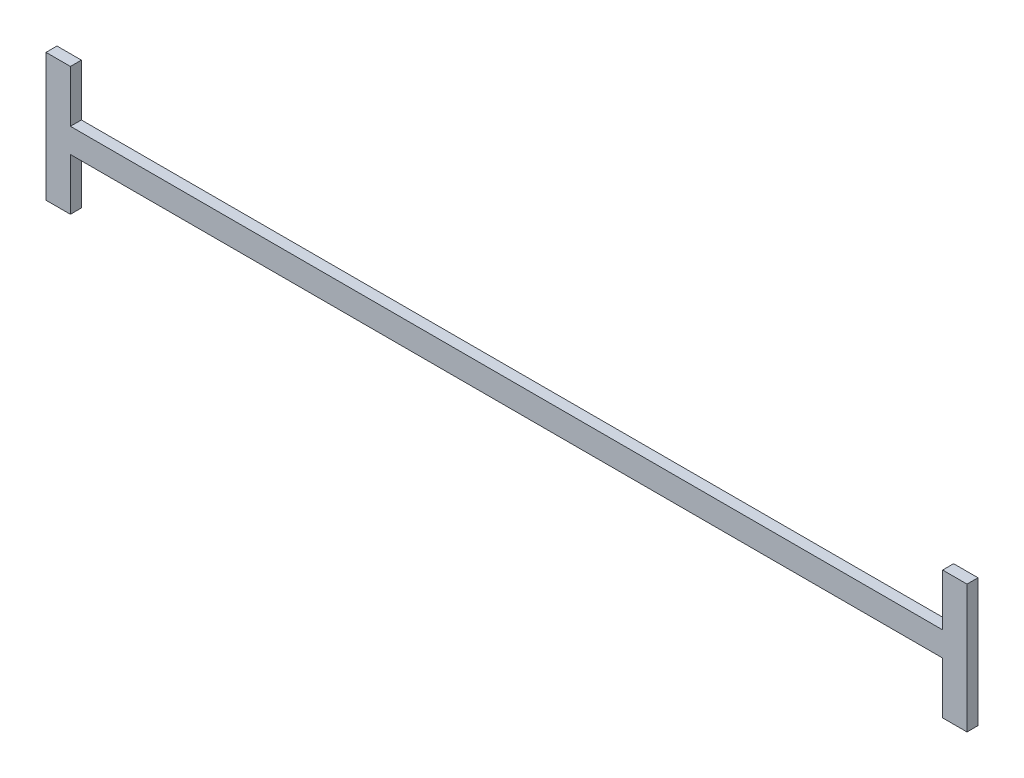
ISO-10303-21;
HEADER;
FILE_DESCRIPTION(('STEP AP214'),'2;1');
FILE_NAME('part.step','',(''),(''),'','','');
FILE_SCHEMA(('AUTOMOTIVE_DESIGN { 1 0 10303 214 1 1 1 1 }'));
ENDSEC;
DATA;
#1=APPLICATION_CONTEXT('core data for automotive mechanical design processes');
#2=APPLICATION_PROTOCOL_DEFINITION('international standard','automotive_design',2000,#1);
#3=PRODUCT_CONTEXT('',#1,'mechanical');
#4=PRODUCT('Part','Part','',(#3));
#5=PRODUCT_RELATED_PRODUCT_CATEGORY('part','',(#4));
#6=PRODUCT_DEFINITION_FORMATION('','',#4);
#7=PRODUCT_DEFINITION_CONTEXT('part definition',#1,'design');
#8=PRODUCT_DEFINITION('design','',#6,#7);
#9=PRODUCT_DEFINITION_SHAPE('','',#8);
#10=(LENGTH_UNIT() NAMED_UNIT(*) SI_UNIT(.MILLI.,.METRE.));
#11=(NAMED_UNIT(*) PLANE_ANGLE_UNIT() SI_UNIT($,.RADIAN.));
#12=(NAMED_UNIT(*) SI_UNIT($,.STERADIAN.) SOLID_ANGLE_UNIT());
#13=UNCERTAINTY_MEASURE_WITH_UNIT(LENGTH_MEASURE(1.E-05),#10,'distance_accuracy_value','');
#14=(GEOMETRIC_REPRESENTATION_CONTEXT(3) GLOBAL_UNCERTAINTY_ASSIGNED_CONTEXT((#13)) GLOBAL_UNIT_ASSIGNED_CONTEXT((#10,
#11,#12)) REPRESENTATION_CONTEXT('',''));
#15=CARTESIAN_POINT('',(0.,0.,0.));
#16=DIRECTION('',(0.,0.,1.));
#17=DIRECTION('',(1.,0.,0.));
#18=AXIS2_PLACEMENT_3D('',#15,#16,#17);
#19=CARTESIAN_POINT('',(-71.5,0.,1.8));
#20=DIRECTION('',(-1.,0.,0.));
#21=DIRECTION('',(0.,0.,1.));
#22=AXIS2_PLACEMENT_3D('',#19,#20,#21);
#23=PLANE('',#22);
#24=DIRECTION('',(0.,1.,0.));
#25=VECTOR('',#24,1.);
#26=CARTESIAN_POINT('',(-71.5,0.,0.));
#27=LINE('',#26,#25);
#28=CARTESIAN_POINT('',(-71.5,-8.50000000000001,0.));
#29=VERTEX_POINT('',#28);
#30=CARTESIAN_POINT('',(-71.5,0.,0.));
#31=VERTEX_POINT('',#30);
#32=EDGE_CURVE('E153',#29,#31,#27,.T.);
#33=ORIENTED_EDGE('',*,*,#32,.T.);
#34=DIRECTION('',(0.,0.,-1.));
#35=VECTOR('',#34,1.);
#36=CARTESIAN_POINT('',(-71.5,0.,1.8));
#37=LINE('',#36,#35);
#38=CARTESIAN_POINT('',(-71.5,0.,1.8));
#39=VERTEX_POINT('',#38);
#40=EDGE_CURVE('E11',#39,#31,#37,.T.);
#41=ORIENTED_EDGE('',*,*,#40,.F.);
#42=DIRECTION('',(0.,1.,0.));
#43=VECTOR('',#42,1.);
#44=CARTESIAN_POINT('',(-71.5,0.,1.8));
#45=LINE('',#44,#43);
#46=CARTESIAN_POINT('',(-71.5,-8.50000000000001,1.8));
#47=VERTEX_POINT('',#46);
#48=EDGE_CURVE('E175',#47,#39,#45,.T.);
#49=ORIENTED_EDGE('',*,*,#48,.F.);
#50=DIRECTION('',(0.,0.,-1.));
#51=VECTOR('',#50,1.);
#52=CARTESIAN_POINT('',(-71.5,-8.50000000000001,1.8));
#53=LINE('',#52,#51);
#54=EDGE_CURVE('E149',#47,#29,#53,.T.);
#55=ORIENTED_EDGE('',*,*,#54,.T.);
#56=EDGE_LOOP('',(#33,#41,#49,#55));
#57=FACE_BOUND('',#56,.T.);
#58=ADVANCED_FACE('F33',(#57),#23,.F.);
#59=CARTESIAN_POINT('',(71.5,0.,1.8));
#60=DIRECTION('',(0.,1.,0.));
#61=DIRECTION('',(0.,0.,1.));
#62=AXIS2_PLACEMENT_3D('',#59,#60,#61);
#63=PLANE('',#62);
#64=DIRECTION('',(1.,0.,0.));
#65=VECTOR('',#64,1.);
#66=CARTESIAN_POINT('',(71.5,0.,0.));
#67=LINE('',#66,#65);
#68=CARTESIAN_POINT('',(71.5,0.,0.));
#69=VERTEX_POINT('',#68);
#70=EDGE_CURVE('E156',#31,#69,#67,.T.);
#71=ORIENTED_EDGE('',*,*,#70,.T.);
#72=DIRECTION('',(0.,0.,-1.));
#73=VECTOR('',#72,1.);
#74=CARTESIAN_POINT('',(71.5,0.,1.8));
#75=LINE('',#74,#73);
#76=CARTESIAN_POINT('',(71.5,0.,1.8));
#77=VERTEX_POINT('',#76);
#78=EDGE_CURVE('E41',#77,#69,#75,.T.);
#79=ORIENTED_EDGE('',*,*,#78,.F.);
#80=DIRECTION('',(1.,0.,0.));
#81=VECTOR('',#80,1.);
#82=CARTESIAN_POINT('',(71.5,0.,1.8));
#83=LINE('',#82,#81);
#84=EDGE_CURVE('E104',#39,#77,#83,.T.);
#85=ORIENTED_EDGE('',*,*,#84,.F.);
#86=ORIENTED_EDGE('',*,*,#40,.T.);
#87=EDGE_LOOP('',(#71,#79,#85,#86));
#88=FACE_BOUND('',#87,.T.);
#89=ADVANCED_FACE('F253',(#88),#63,.F.);
#90=CARTESIAN_POINT('',(71.5,0.,1.8));
#91=DIRECTION('',(1.,0.,0.));
#92=DIRECTION('',(0.,0.,-1.));
#93=AXIS2_PLACEMENT_3D('',#90,#91,#92);
#94=PLANE('',#93);
#95=DIRECTION('',(0.,-1.,0.));
#96=VECTOR('',#95,1.);
#97=CARTESIAN_POINT('',(71.5,0.,0.));
#98=LINE('',#97,#96);
#99=CARTESIAN_POINT('',(71.5,-8.50000000000001,0.));
#100=VERTEX_POINT('',#99);
#101=EDGE_CURVE('E158',#69,#100,#98,.T.);
#102=ORIENTED_EDGE('',*,*,#101,.T.);
#103=DIRECTION('',(0.,0.,-1.));
#104=VECTOR('',#103,1.);
#105=CARTESIAN_POINT('',(71.5,-8.50000000000001,1.8));
#106=LINE('',#105,#104);
#107=CARTESIAN_POINT('',(71.5,-8.50000000000001,1.8));
#108=VERTEX_POINT('',#107);
#109=EDGE_CURVE('E194',#108,#100,#106,.T.);
#110=ORIENTED_EDGE('',*,*,#109,.F.);
#111=DIRECTION('',(0.,-1.,0.));
#112=VECTOR('',#111,1.);
#113=CARTESIAN_POINT('',(71.5,0.,1.8));
#114=LINE('',#113,#112);
#115=EDGE_CURVE('E202',#77,#108,#114,.T.);
#116=ORIENTED_EDGE('',*,*,#115,.F.);
#117=ORIENTED_EDGE('',*,*,#78,.T.);
#118=EDGE_LOOP('',(#102,#110,#116,#117));
#119=FACE_BOUND('',#118,.T.);
#120=ADVANCED_FACE('F200',(#119),#94,.F.);
#121=CARTESIAN_POINT('',(71.5,-8.50000000000001,1.8));
#122=DIRECTION('',(0.,1.,0.));
#123=DIRECTION('',(0.,0.,1.));
#124=AXIS2_PLACEMENT_3D('',#121,#122,#123);
#125=PLANE('',#124);
#126=DIRECTION('',(1.,0.,0.));
#127=VECTOR('',#126,1.);
#128=CARTESIAN_POINT('',(71.5,-8.50000000000001,0.));
#129=LINE('',#128,#127);
#130=CARTESIAN_POINT('',(75.5,-8.50000000000001,0.));
#131=VERTEX_POINT('',#130);
#132=EDGE_CURVE('E160',#100,#131,#129,.T.);
#133=ORIENTED_EDGE('',*,*,#132,.T.);
#134=DIRECTION('',(0.,0.,-1.));
#135=VECTOR('',#134,1.);
#136=CARTESIAN_POINT('',(75.5,-8.50000000000001,1.8));
#137=LINE('',#136,#135);
#138=CARTESIAN_POINT('',(75.5,-8.50000000000001,1.8));
#139=VERTEX_POINT('',#138);
#140=EDGE_CURVE('E191',#139,#131,#137,.T.);
#141=ORIENTED_EDGE('',*,*,#140,.F.);
#142=DIRECTION('',(1.,0.,0.));
#143=VECTOR('',#142,1.);
#144=CARTESIAN_POINT('',(71.5,-8.50000000000001,1.8));
#145=LINE('',#144,#143);
#146=EDGE_CURVE('E220',#108,#139,#145,.T.);
#147=ORIENTED_EDGE('',*,*,#146,.F.);
#148=ORIENTED_EDGE('',*,*,#109,.T.);
#149=EDGE_LOOP('',(#133,#141,#147,#148));
#150=FACE_BOUND('',#149,.T.);
#151=ADVANCED_FACE('F211',(#150),#125,.F.);
#152=CARTESIAN_POINT('',(75.5,-8.50000000000001,1.8));
#153=DIRECTION('',(-1.,0.,0.));
#154=DIRECTION('',(0.,0.,1.));
#155=AXIS2_PLACEMENT_3D('',#152,#153,#154);
#156=PLANE('',#155);
#157=DIRECTION('',(0.,1.,0.));
#158=VECTOR('',#157,1.);
#159=CARTESIAN_POINT('',(75.5,-8.50000000000001,0.));
#160=LINE('',#159,#158);
#161=CARTESIAN_POINT('',(75.5,12.5,0.));
#162=VERTEX_POINT('',#161);
#163=EDGE_CURVE('E162',#131,#162,#160,.T.);
#164=ORIENTED_EDGE('',*,*,#163,.T.);
#165=DIRECTION('',(0.,0.,-1.));
#166=VECTOR('',#165,1.);
#167=CARTESIAN_POINT('',(75.5,12.5,1.8));
#168=LINE('',#167,#166);
#169=CARTESIAN_POINT('',(75.5,12.5,1.8));
#170=VERTEX_POINT('',#169);
#171=EDGE_CURVE('E188',#170,#162,#168,.T.);
#172=ORIENTED_EDGE('',*,*,#171,.F.);
#173=DIRECTION('',(0.,1.,0.));
#174=VECTOR('',#173,1.);
#175=CARTESIAN_POINT('',(75.5,-8.50000000000001,1.8));
#176=LINE('',#175,#174);
#177=EDGE_CURVE('E217',#139,#170,#176,.T.);
#178=ORIENTED_EDGE('',*,*,#177,.F.);
#179=ORIENTED_EDGE('',*,*,#140,.T.);
#180=EDGE_LOOP('',(#164,#172,#178,#179));
#181=FACE_BOUND('',#180,.T.);
#182=ADVANCED_FACE('F215',(#181),#156,.F.);
#183=CARTESIAN_POINT('',(75.5,12.5,1.8));
#184=DIRECTION('',(0.,-1.,0.));
#185=DIRECTION('',(0.,0.,-1.));
#186=AXIS2_PLACEMENT_3D('',#183,#184,#185);
#187=PLANE('',#186);
#188=DIRECTION('',(-1.,0.,0.));
#189=VECTOR('',#188,1.);
#190=CARTESIAN_POINT('',(75.5,12.5,0.));
#191=LINE('',#190,#189);
#192=CARTESIAN_POINT('',(71.5,12.5,0.));
#193=VERTEX_POINT('',#192);
#194=EDGE_CURVE('E164',#162,#193,#191,.T.);
#195=ORIENTED_EDGE('',*,*,#194,.T.);
#196=DIRECTION('',(0.,0.,-1.));
#197=VECTOR('',#196,1.);
#198=CARTESIAN_POINT('',(71.5,12.5,1.8));
#199=LINE('',#198,#197);
#200=CARTESIAN_POINT('',(71.5,12.5,1.8));
#201=VERTEX_POINT('',#200);
#202=EDGE_CURVE('E185',#201,#193,#199,.T.);
#203=ORIENTED_EDGE('',*,*,#202,.F.);
#204=DIRECTION('',(-1.,0.,0.));
#205=VECTOR('',#204,1.);
#206=CARTESIAN_POINT('',(75.5,12.5,1.8));
#207=LINE('',#206,#205);
#208=EDGE_CURVE('E219',#170,#201,#207,.T.);
#209=ORIENTED_EDGE('',*,*,#208,.F.);
#210=ORIENTED_EDGE('',*,*,#171,.T.);
#211=EDGE_LOOP('',(#195,#203,#209,#210));
#212=FACE_BOUND('',#211,.T.);
#213=ADVANCED_FACE('F266',(#212),#187,.F.);
#214=CARTESIAN_POINT('',(71.5,12.5,1.8));
#215=DIRECTION('',(1.,0.,0.));
#216=DIRECTION('',(0.,0.,-1.));
#217=AXIS2_PLACEMENT_3D('',#214,#215,#216);
#218=PLANE('',#217);
#219=DIRECTION('',(0.,-1.,0.));
#220=VECTOR('',#219,1.);
#221=CARTESIAN_POINT('',(71.5,12.5,0.));
#222=LINE('',#221,#220);
#223=CARTESIAN_POINT('',(71.5,3.99999999999999,0.));
#224=VERTEX_POINT('',#223);
#225=EDGE_CURVE('E166',#193,#224,#222,.T.);
#226=ORIENTED_EDGE('',*,*,#225,.T.);
#227=DIRECTION('',(0.,0.,-1.));
#228=VECTOR('',#227,1.);
#229=CARTESIAN_POINT('',(71.5,3.99999999999999,1.8));
#230=LINE('',#229,#228);
#231=CARTESIAN_POINT('',(71.5,3.99999999999999,1.8));
#232=VERTEX_POINT('',#231);
#233=EDGE_CURVE('E182',#232,#224,#230,.T.);
#234=ORIENTED_EDGE('',*,*,#233,.F.);
#235=DIRECTION('',(0.,-1.,0.));
#236=VECTOR('',#235,1.);
#237=CARTESIAN_POINT('',(71.5,12.5,1.8));
#238=LINE('',#237,#236);
#239=EDGE_CURVE('E222',#201,#232,#238,.T.);
#240=ORIENTED_EDGE('',*,*,#239,.F.);
#241=ORIENTED_EDGE('',*,*,#202,.T.);
#242=EDGE_LOOP('',(#226,#234,#240,#241));
#243=FACE_BOUND('',#242,.T.);
#244=ADVANCED_FACE('F269',(#243),#218,.F.);
#245=CARTESIAN_POINT('',(-71.5,3.99999999999999,1.8));
#246=DIRECTION('',(0.,-1.,0.));
#247=DIRECTION('',(0.,0.,-1.));
#248=AXIS2_PLACEMENT_3D('',#245,#246,#247);
#249=PLANE('',#248);
#250=DIRECTION('',(-1.,0.,0.));
#251=VECTOR('',#250,1.);
#252=CARTESIAN_POINT('',(-71.5,3.99999999999999,0.));
#253=LINE('',#252,#251);
#254=CARTESIAN_POINT('',(-71.5,3.99999999999999,0.));
#255=VERTEX_POINT('',#254);
#256=EDGE_CURVE('E168',#224,#255,#253,.T.);
#257=ORIENTED_EDGE('',*,*,#256,.T.);
#258=DIRECTION('',(0.,0.,-1.));
#259=VECTOR('',#258,1.);
#260=CARTESIAN_POINT('',(-71.5,3.99999999999999,1.8));
#261=LINE('',#260,#259);
#262=CARTESIAN_POINT('',(-71.5,3.99999999999999,1.8));
#263=VERTEX_POINT('',#262);
#264=EDGE_CURVE('E179',#263,#255,#261,.T.);
#265=ORIENTED_EDGE('',*,*,#264,.F.);
#266=DIRECTION('',(-1.,0.,0.));
#267=VECTOR('',#266,1.);
#268=CARTESIAN_POINT('',(-71.5,3.99999999999999,1.8));
#269=LINE('',#268,#267);
#270=EDGE_CURVE('E228',#232,#263,#269,.T.);
#271=ORIENTED_EDGE('',*,*,#270,.F.);
#272=ORIENTED_EDGE('',*,*,#233,.T.);
#273=EDGE_LOOP('',(#257,#265,#271,#272));
#274=FACE_BOUND('',#273,.T.);
#275=ADVANCED_FACE('F234',(#274),#249,.F.);
#276=CARTESIAN_POINT('',(-71.5,12.5,1.8));
#277=DIRECTION('',(-1.,0.,0.));
#278=DIRECTION('',(0.,0.,1.));
#279=AXIS2_PLACEMENT_3D('',#276,#277,#278);
#280=PLANE('',#279);
#281=DIRECTION('',(0.,1.,0.));
#282=VECTOR('',#281,1.);
#283=CARTESIAN_POINT('',(-71.5,12.5,0.));
#284=LINE('',#283,#282);
#285=CARTESIAN_POINT('',(-71.5,12.5,0.));
#286=VERTEX_POINT('',#285);
#287=EDGE_CURVE('E170',#255,#286,#284,.T.);
#288=ORIENTED_EDGE('',*,*,#287,.T.);
#289=DIRECTION('',(0.,0.,-1.));
#290=VECTOR('',#289,1.);
#291=CARTESIAN_POINT('',(-71.5,12.5,1.8));
#292=LINE('',#291,#290);
#293=CARTESIAN_POINT('',(-71.5,12.5,1.8));
#294=VERTEX_POINT('',#293);
#295=EDGE_CURVE('E144',#294,#286,#292,.T.);
#296=ORIENTED_EDGE('',*,*,#295,.F.);
#297=DIRECTION('',(0.,1.,0.));
#298=VECTOR('',#297,1.);
#299=CARTESIAN_POINT('',(-71.5,12.5,1.8));
#300=LINE('',#299,#298);
#301=EDGE_CURVE('E135',#263,#294,#300,.T.);
#302=ORIENTED_EDGE('',*,*,#301,.F.);
#303=ORIENTED_EDGE('',*,*,#264,.T.);
#304=EDGE_LOOP('',(#288,#296,#302,#303));
#305=FACE_BOUND('',#304,.T.);
#306=ADVANCED_FACE('F238',(#305),#280,.F.);
#307=CARTESIAN_POINT('',(-75.5,12.5,1.8));
#308=DIRECTION('',(0.,-1.,0.));
#309=DIRECTION('',(0.,0.,-1.));
#310=AXIS2_PLACEMENT_3D('',#307,#308,#309);
#311=PLANE('',#310);
#312=DIRECTION('',(-1.,0.,0.));
#313=VECTOR('',#312,1.);
#314=CARTESIAN_POINT('',(-75.5,12.5,0.));
#315=LINE('',#314,#313);
#316=CARTESIAN_POINT('',(-75.5,12.5,0.));
#317=VERTEX_POINT('',#316);
#318=EDGE_CURVE('E143',#286,#317,#315,.T.);
#319=ORIENTED_EDGE('',*,*,#318,.T.);
#320=DIRECTION('',(0.,0.,-1.));
#321=VECTOR('',#320,1.);
#322=CARTESIAN_POINT('',(-75.5,12.5,1.8));
#323=LINE('',#322,#321);
#324=CARTESIAN_POINT('',(-75.5,12.5,1.8));
#325=VERTEX_POINT('',#324);
#326=EDGE_CURVE('E140',#325,#317,#323,.T.);
#327=ORIENTED_EDGE('',*,*,#326,.F.);
#328=DIRECTION('',(-1.,0.,0.));
#329=VECTOR('',#328,1.);
#330=CARTESIAN_POINT('',(-75.5,12.5,1.8));
#331=LINE('',#330,#329);
#332=EDGE_CURVE('E129',#294,#325,#331,.T.);
#333=ORIENTED_EDGE('',*,*,#332,.F.);
#334=ORIENTED_EDGE('',*,*,#295,.T.);
#335=EDGE_LOOP('',(#319,#327,#333,#334));
#336=FACE_BOUND('',#335,.T.);
#337=ADVANCED_FACE('F141',(#336),#311,.F.);
#338=CARTESIAN_POINT('',(-75.5,-8.50000000000001,1.8));
#339=DIRECTION('',(1.,0.,0.));
#340=DIRECTION('',(0.,0.,-1.));
#341=AXIS2_PLACEMENT_3D('',#338,#339,#340);
#342=PLANE('',#341);
#343=DIRECTION('',(0.,-1.,0.));
#344=VECTOR('',#343,1.);
#345=CARTESIAN_POINT('',(-75.5,-8.50000000000001,0.));
#346=LINE('',#345,#344);
#347=CARTESIAN_POINT('',(-75.5,-8.50000000000001,0.));
#348=VERTEX_POINT('',#347);
#349=EDGE_CURVE('E90',#317,#348,#346,.T.);
#350=ORIENTED_EDGE('',*,*,#349,.T.);
#351=DIRECTION('',(0.,0.,-1.));
#352=VECTOR('',#351,1.);
#353=CARTESIAN_POINT('',(-75.5,-8.50000000000001,1.8));
#354=LINE('',#353,#352);
#355=CARTESIAN_POINT('',(-75.5,-8.50000000000001,1.8));
#356=VERTEX_POINT('',#355);
#357=EDGE_CURVE('E145',#356,#348,#354,.T.);
#358=ORIENTED_EDGE('',*,*,#357,.F.);
#359=DIRECTION('',(0.,-1.,0.));
#360=VECTOR('',#359,1.);
#361=CARTESIAN_POINT('',(-75.5,-8.50000000000001,1.8));
#362=LINE('',#361,#360);
#363=EDGE_CURVE('E133',#325,#356,#362,.T.);
#364=ORIENTED_EDGE('',*,*,#363,.F.);
#365=ORIENTED_EDGE('',*,*,#326,.T.);
#366=EDGE_LOOP('',(#350,#358,#364,#365));
#367=FACE_BOUND('',#366,.T.);
#368=ADVANCED_FACE('F147',(#367),#342,.F.);
#369=CARTESIAN_POINT('',(-71.5,-8.50000000000001,1.8));
#370=DIRECTION('',(0.,1.,0.));
#371=DIRECTION('',(0.,0.,1.));
#372=AXIS2_PLACEMENT_3D('',#369,#370,#371);
#373=PLANE('',#372);
#374=DIRECTION('',(1.,0.,0.));
#375=VECTOR('',#374,1.);
#376=CARTESIAN_POINT('',(-71.5,-8.50000000000001,0.));
#377=LINE('',#376,#375);
#378=EDGE_CURVE('E96',#348,#29,#377,.T.);
#379=ORIENTED_EDGE('',*,*,#378,.T.);
#380=ORIENTED_EDGE('',*,*,#54,.F.);
#381=DIRECTION('',(1.,0.,0.));
#382=VECTOR('',#381,1.);
#383=CARTESIAN_POINT('',(-71.5,-8.50000000000001,1.8));
#384=LINE('',#383,#382);
#385=EDGE_CURVE('E49',#356,#47,#384,.T.);
#386=ORIENTED_EDGE('',*,*,#385,.F.);
#387=ORIENTED_EDGE('',*,*,#357,.T.);
#388=EDGE_LOOP('',(#379,#380,#386,#387));
#389=FACE_BOUND('',#388,.T.);
#390=ADVANCED_FACE('F242',(#389),#373,.F.);
#391=CARTESIAN_POINT('',(0.,0.,1.8));
#392=DIRECTION('',(0.,0.,-1.));
#393=DIRECTION('',(-1.,0.,0.));
#394=AXIS2_PLACEMENT_3D('',#391,#392,#393);
#395=PLANE('',#394);
#396=ORIENTED_EDGE('',*,*,#48,.T.);
#397=ORIENTED_EDGE('',*,*,#84,.T.);
#398=ORIENTED_EDGE('',*,*,#115,.T.);
#399=ORIENTED_EDGE('',*,*,#146,.T.);
#400=ORIENTED_EDGE('',*,*,#177,.T.);
#401=ORIENTED_EDGE('',*,*,#208,.T.);
#402=ORIENTED_EDGE('',*,*,#239,.T.);
#403=ORIENTED_EDGE('',*,*,#270,.T.);
#404=ORIENTED_EDGE('',*,*,#301,.T.);
#405=ORIENTED_EDGE('',*,*,#332,.T.);
#406=ORIENTED_EDGE('',*,*,#363,.T.);
#407=ORIENTED_EDGE('',*,*,#385,.T.);
#408=EDGE_LOOP('',(#396,#397,#398,#399,#400,#401,#402,#403,#404,#405,#406,#407));
#409=FACE_BOUND('',#408,.T.);
#410=ADVANCED_FACE('F131',(#409),#395,.F.);
#411=CARTESIAN_POINT('',(0.,0.,0.));
#412=DIRECTION('',(0.,0.,-1.));
#413=DIRECTION('',(-1.,0.,0.));
#414=AXIS2_PLACEMENT_3D('',#411,#412,#413);
#415=PLANE('',#414);
#416=ORIENTED_EDGE('',*,*,#32,.F.);
#417=ORIENTED_EDGE('',*,*,#378,.F.);
#418=ORIENTED_EDGE('',*,*,#349,.F.);
#419=ORIENTED_EDGE('',*,*,#318,.F.);
#420=ORIENTED_EDGE('',*,*,#287,.F.);
#421=ORIENTED_EDGE('',*,*,#256,.F.);
#422=ORIENTED_EDGE('',*,*,#225,.F.);
#423=ORIENTED_EDGE('',*,*,#194,.F.);
#424=ORIENTED_EDGE('',*,*,#163,.F.);
#425=ORIENTED_EDGE('',*,*,#132,.F.);
#426=ORIENTED_EDGE('',*,*,#101,.F.);
#427=ORIENTED_EDGE('',*,*,#70,.F.);
#428=EDGE_LOOP('',(#416,#417,#418,#419,#420,#421,#422,#423,#424,#425,#426,#427));
#429=FACE_BOUND('',#428,.T.);
#430=ADVANCED_FACE('F206',(#429),#415,.T.);
#431=CLOSED_SHELL('',(#58,#89,#120,#151,#182,#213,#244,#275,#306,#337,#368,#390,#410,#430));
#432=MANIFOLD_SOLID_BREP('B2',#431);
#433=ADVANCED_BREP_SHAPE_REPRESENTATION('',(#18,#432),#14);
#434=SHAPE_DEFINITION_REPRESENTATION(#9,#433);
ENDSEC;
END-ISO-10303-21;
